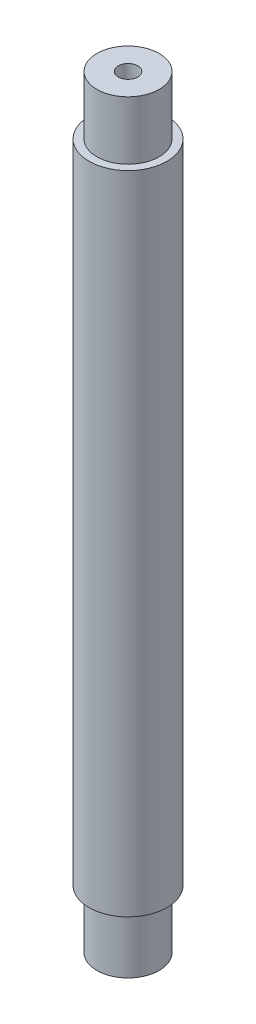
ISO-10303-21;
HEADER;
FILE_DESCRIPTION(('STEP AP214'),'2;1');
FILE_NAME('part.step','',(''),(''),'','','');
FILE_SCHEMA(('AUTOMOTIVE_DESIGN { 1 0 10303 214 1 1 1 1 }'));
ENDSEC;
DATA;
#1=APPLICATION_CONTEXT('core data for automotive mechanical design processes');
#2=APPLICATION_PROTOCOL_DEFINITION('international standard','automotive_design',2000,#1);
#3=PRODUCT_CONTEXT('',#1,'mechanical');
#4=PRODUCT('Part','Part','',(#3));
#5=PRODUCT_RELATED_PRODUCT_CATEGORY('part','',(#4));
#6=PRODUCT_DEFINITION_FORMATION('','',#4);
#7=PRODUCT_DEFINITION_CONTEXT('part definition',#1,'design');
#8=PRODUCT_DEFINITION('design','',#6,#7);
#9=PRODUCT_DEFINITION_SHAPE('','',#8);
#10=(LENGTH_UNIT() NAMED_UNIT(*) SI_UNIT(.MILLI.,.METRE.));
#11=(NAMED_UNIT(*) PLANE_ANGLE_UNIT() SI_UNIT($,.RADIAN.));
#12=(NAMED_UNIT(*) SI_UNIT($,.STERADIAN.) SOLID_ANGLE_UNIT());
#13=UNCERTAINTY_MEASURE_WITH_UNIT(LENGTH_MEASURE(1.E-05),#10,'distance_accuracy_value','');
#14=(GEOMETRIC_REPRESENTATION_CONTEXT(3) GLOBAL_UNCERTAINTY_ASSIGNED_CONTEXT((#13)) GLOBAL_UNIT_ASSIGNED_CONTEXT((#10,
#11,#12)) REPRESENTATION_CONTEXT('',''));
#15=CARTESIAN_POINT('',(0.,0.,0.));
#16=DIRECTION('',(0.,0.,1.));
#17=DIRECTION('',(1.,0.,0.));
#18=AXIS2_PLACEMENT_3D('',#15,#16,#17);
#19=CARTESIAN_POINT('',(0.,0.,0.));
#20=DIRECTION('',(0.,-1.,0.));
#21=DIRECTION('',(0.,0.,-1.));
#22=AXIS2_PLACEMENT_3D('',#19,#20,#21);
#23=CYLINDRICAL_SURFACE('',#22,7.99999999999999);
#24=CARTESIAN_POINT('',(0.,18.,0.));
#25=DIRECTION('',(0.,-1.,0.));
#26=DIRECTION('',(0.,0.,-1.));
#27=AXIS2_PLACEMENT_3D('',#24,#25,#26);
#28=CIRCLE('',#27,8.);
#29=CARTESIAN_POINT('',(0.,18.,-8.));
#30=VERTEX_POINT('',#29);
#31=EDGE_CURVE('E10',#30,#30,#28,.T.);
#32=ORIENTED_EDGE('',*,*,#31,.T.);
#33=EDGE_LOOP('',(#32));
#34=FACE_BOUND('',#33,.T.);
#35=CARTESIAN_POINT('',(0.,178.,0.));
#36=DIRECTION('',(0.,-1.,0.));
#37=DIRECTION('',(0.,0.,-1.));
#38=AXIS2_PLACEMENT_3D('',#35,#36,#37);
#39=CIRCLE('',#38,7.99999999999998);
#40=CARTESIAN_POINT('',(0.,178.,-7.99999999999998));
#41=VERTEX_POINT('',#40);
#42=EDGE_CURVE('E66',#41,#41,#39,.T.);
#43=ORIENTED_EDGE('',*,*,#42,.F.);
#44=EDGE_LOOP('',(#43));
#45=FACE_BOUND('',#44,.T.);
#46=ADVANCED_FACE('F32',(#34,#45),#23,.F.);
#47=CARTESIAN_POINT('',(0.,18.,0.));
#48=DIRECTION('',(0.,1.,0.));
#49=DIRECTION('',(0.,0.,1.));
#50=AXIS2_PLACEMENT_3D('',#47,#48,#49);
#51=PLANE('',#50);
#52=ORIENTED_EDGE('',*,*,#31,.F.);
#53=EDGE_LOOP('',(#52));
#54=FACE_BOUND('',#53,.T.);
#55=ADVANCED_FACE('F74',(#54),#51,.T.);
#56=CARTESIAN_POINT('',(0.,0.,0.));
#57=DIRECTION('',(0.,-1.,0.));
#58=DIRECTION('',(0.,0.,-1.));
#59=AXIS2_PLACEMENT_3D('',#56,#57,#58);
#60=PLANE('',#59);
#61=CARTESIAN_POINT('',(0.,0.,0.));
#62=DIRECTION('',(0.,-1.,0.));
#63=DIRECTION('',(0.,0.,-1.));
#64=AXIS2_PLACEMENT_3D('',#61,#62,#63);
#65=CIRCLE('',#64,8.);
#66=CARTESIAN_POINT('',(0.,0.,-8.));
#67=VERTEX_POINT('',#66);
#68=EDGE_CURVE('E38',#67,#67,#65,.T.);
#69=ORIENTED_EDGE('',*,*,#68,.T.);
#70=EDGE_LOOP('',(#69));
#71=FACE_BOUND('',#70,.T.);
#72=ADVANCED_FACE('F78',(#71),#60,.T.);
#73=CARTESIAN_POINT('',(0.,0.,0.));
#74=DIRECTION('',(0.,-1.,0.));
#75=DIRECTION('',(0.,0.,-1.));
#76=AXIS2_PLACEMENT_3D('',#73,#74,#75);
#77=CYLINDRICAL_SURFACE('',#76,8.);
#78=CARTESIAN_POINT('',(0.,15.,0.));
#79=DIRECTION('',(0.,-1.,0.));
#80=DIRECTION('',(0.,0.,-1.));
#81=AXIS2_PLACEMENT_3D('',#78,#79,#80);
#82=CIRCLE('',#81,8.);
#83=CARTESIAN_POINT('',(0.,15.,-8.));
#84=VERTEX_POINT('',#83);
#85=EDGE_CURVE('E42',#84,#84,#82,.T.);
#86=ORIENTED_EDGE('',*,*,#85,.T.);
#87=EDGE_LOOP('',(#86));
#88=FACE_BOUND('',#87,.T.);
#89=ORIENTED_EDGE('',*,*,#68,.F.);
#90=EDGE_LOOP('',(#89));
#91=FACE_BOUND('',#90,.T.);
#92=ADVANCED_FACE('F83',(#88,#91),#77,.T.);
#93=CARTESIAN_POINT('',(0.,15.,0.));
#94=DIRECTION('',(0.,-1.,0.));
#95=DIRECTION('',(0.,0.,-1.));
#96=AXIS2_PLACEMENT_3D('',#93,#94,#95);
#97=PLANE('',#96);
#98=CARTESIAN_POINT('',(0.,15.,0.));
#99=DIRECTION('',(0.,-1.,0.));
#100=DIRECTION('',(0.,0.,-1.));
#101=AXIS2_PLACEMENT_3D('',#98,#99,#100);
#102=CIRCLE('',#101,10.);
#103=CARTESIAN_POINT('',(0.,15.,-10.));
#104=VERTEX_POINT('',#103);
#105=EDGE_CURVE('E46',#104,#104,#102,.T.);
#106=ORIENTED_EDGE('',*,*,#105,.T.);
#107=EDGE_LOOP('',(#106));
#108=FACE_BOUND('',#107,.T.);
#109=ORIENTED_EDGE('',*,*,#85,.F.);
#110=EDGE_LOOP('',(#109));
#111=FACE_BOUND('',#110,.T.);
#112=ADVANCED_FACE('F88',(#108,#111),#97,.T.);
#113=CARTESIAN_POINT('',(0.,0.,0.));
#114=DIRECTION('',(0.,-1.,0.));
#115=DIRECTION('',(0.,0.,-1.));
#116=AXIS2_PLACEMENT_3D('',#113,#114,#115);
#117=CYLINDRICAL_SURFACE('',#116,10.);
#118=CARTESIAN_POINT('',(0.,181.,0.));
#119=DIRECTION('',(0.,-1.,0.));
#120=DIRECTION('',(0.,0.,-1.));
#121=AXIS2_PLACEMENT_3D('',#118,#119,#120);
#122=CIRCLE('',#121,10.);
#123=CARTESIAN_POINT('',(0.,181.,-10.));
#124=VERTEX_POINT('',#123);
#125=EDGE_CURVE('E51',#124,#124,#122,.T.);
#126=ORIENTED_EDGE('',*,*,#125,.T.);
#127=EDGE_LOOP('',(#126));
#128=FACE_BOUND('',#127,.T.);
#129=ORIENTED_EDGE('',*,*,#105,.F.);
#130=EDGE_LOOP('',(#129));
#131=FACE_BOUND('',#130,.T.);
#132=ADVANCED_FACE('F92',(#128,#131),#117,.T.);
#133=CARTESIAN_POINT('',(0.,181.,0.));
#134=DIRECTION('',(0.,1.,0.));
#135=DIRECTION('',(0.,0.,1.));
#136=AXIS2_PLACEMENT_3D('',#133,#134,#135);
#137=PLANE('',#136);
#138=CARTESIAN_POINT('',(0.,181.,0.));
#139=DIRECTION('',(0.,-1.,0.));
#140=DIRECTION('',(0.,0.,-1.));
#141=AXIS2_PLACEMENT_3D('',#138,#139,#140);
#142=CIRCLE('',#141,7.99999999999997);
#143=CARTESIAN_POINT('',(0.,181.,-7.99999999999997));
#144=VERTEX_POINT('',#143);
#145=EDGE_CURVE('E54',#144,#144,#142,.T.);
#146=ORIENTED_EDGE('',*,*,#145,.T.);
#147=EDGE_LOOP('',(#146));
#148=FACE_BOUND('',#147,.T.);
#149=ORIENTED_EDGE('',*,*,#125,.F.);
#150=EDGE_LOOP('',(#149));
#151=FACE_BOUND('',#150,.T.);
#152=ADVANCED_FACE('F96',(#148,#151),#137,.T.);
#153=CARTESIAN_POINT('',(0.,0.,0.));
#154=DIRECTION('',(0.,-1.,0.));
#155=DIRECTION('',(0.,0.,-1.));
#156=AXIS2_PLACEMENT_3D('',#153,#154,#155);
#157=CYLINDRICAL_SURFACE('',#156,7.99999999999998);
#158=CARTESIAN_POINT('',(0.,196.,0.));
#159=DIRECTION('',(0.,-1.,0.));
#160=DIRECTION('',(0.,0.,-1.));
#161=AXIS2_PLACEMENT_3D('',#158,#159,#160);
#162=CIRCLE('',#161,7.99999999999998);
#163=CARTESIAN_POINT('',(0.,196.,-7.99999999999998));
#164=VERTEX_POINT('',#163);
#165=EDGE_CURVE('E57',#164,#164,#162,.T.);
#166=ORIENTED_EDGE('',*,*,#165,.T.);
#167=EDGE_LOOP('',(#166));
#168=FACE_BOUND('',#167,.T.);
#169=ORIENTED_EDGE('',*,*,#145,.F.);
#170=EDGE_LOOP('',(#169));
#171=FACE_BOUND('',#170,.T.);
#172=ADVANCED_FACE('F100',(#168,#171),#157,.T.);
#173=CARTESIAN_POINT('',(0.,196.,0.));
#174=DIRECTION('',(0.,1.,0.));
#175=DIRECTION('',(0.,0.,1.));
#176=AXIS2_PLACEMENT_3D('',#173,#174,#175);
#177=PLANE('',#176);
#178=CARTESIAN_POINT('',(0.,196.,0.));
#179=DIRECTION('',(0.,-1.,0.));
#180=DIRECTION('',(0.,0.,-1.));
#181=AXIS2_PLACEMENT_3D('',#178,#179,#180);
#182=CIRCLE('',#181,2.5);
#183=CARTESIAN_POINT('',(0.,196.,-2.5));
#184=VERTEX_POINT('',#183);
#185=EDGE_CURVE('E60',#184,#184,#182,.T.);
#186=ORIENTED_EDGE('',*,*,#185,.T.);
#187=EDGE_LOOP('',(#186));
#188=FACE_BOUND('',#187,.T.);
#189=ORIENTED_EDGE('',*,*,#165,.F.);
#190=EDGE_LOOP('',(#189));
#191=FACE_BOUND('',#190,.T.);
#192=ADVANCED_FACE('F104',(#188,#191),#177,.T.);
#193=CARTESIAN_POINT('',(0.,0.,0.));
#194=DIRECTION('',(0.,-1.,0.));
#195=DIRECTION('',(0.,0.,-1.));
#196=AXIS2_PLACEMENT_3D('',#193,#194,#195);
#197=CYLINDRICAL_SURFACE('',#196,2.5);
#198=CARTESIAN_POINT('',(0.,178.,0.));
#199=DIRECTION('',(0.,-1.,0.));
#200=DIRECTION('',(0.,0.,-1.));
#201=AXIS2_PLACEMENT_3D('',#198,#199,#200);
#202=CIRCLE('',#201,2.5);
#203=CARTESIAN_POINT('',(0.,178.,-2.5));
#204=VERTEX_POINT('',#203);
#205=EDGE_CURVE('E63',#204,#204,#202,.T.);
#206=ORIENTED_EDGE('',*,*,#205,.T.);
#207=EDGE_LOOP('',(#206));
#208=FACE_BOUND('',#207,.T.);
#209=ORIENTED_EDGE('',*,*,#185,.F.);
#210=EDGE_LOOP('',(#209));
#211=FACE_BOUND('',#210,.T.);
#212=ADVANCED_FACE('F108',(#208,#211),#197,.F.);
#213=CARTESIAN_POINT('',(0.,178.,0.));
#214=DIRECTION('',(0.,-1.,0.));
#215=DIRECTION('',(0.,0.,-1.));
#216=AXIS2_PLACEMENT_3D('',#213,#214,#215);
#217=PLANE('',#216);
#218=ORIENTED_EDGE('',*,*,#42,.T.);
#219=EDGE_LOOP('',(#218));
#220=FACE_BOUND('',#219,.T.);
#221=ORIENTED_EDGE('',*,*,#205,.F.);
#222=EDGE_LOOP('',(#221));
#223=FACE_BOUND('',#222,.T.);
#224=ADVANCED_FACE('F70',(#220,#223),#217,.T.);
#225=CLOSED_SHELL('',(#46,#55,#72,#92,#112,#132,#152,#172,#192,#212,#224));
#226=MANIFOLD_SOLID_BREP('B2',#225);
#227=ADVANCED_BREP_SHAPE_REPRESENTATION('',(#18,#226),#14);
#228=SHAPE_DEFINITION_REPRESENTATION(#9,#227);
ENDSEC;
END-ISO-10303-21;
